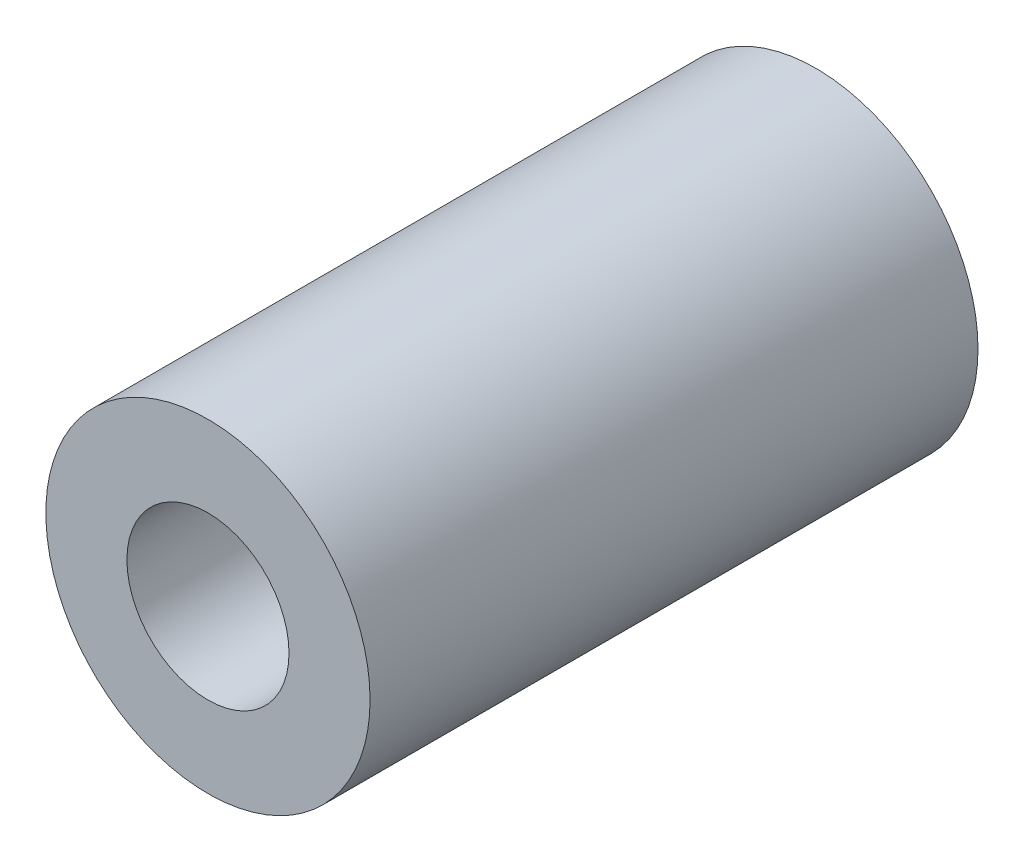
ISO-10303-21;
HEADER;
FILE_DESCRIPTION(('STEP AP214'),'2;1');
FILE_NAME('part.step','',(''),(''),'','','');
FILE_SCHEMA(('AUTOMOTIVE_DESIGN { 1 0 10303 214 1 1 1 1 }'));
ENDSEC;
DATA;
#1=APPLICATION_CONTEXT('core data for automotive mechanical design processes');
#2=APPLICATION_PROTOCOL_DEFINITION('international standard','automotive_design',2000,#1);
#3=PRODUCT_CONTEXT('',#1,'mechanical');
#4=PRODUCT('Part','Part','',(#3));
#5=PRODUCT_RELATED_PRODUCT_CATEGORY('part','',(#4));
#6=PRODUCT_DEFINITION_FORMATION('','',#4);
#7=PRODUCT_DEFINITION_CONTEXT('part definition',#1,'design');
#8=PRODUCT_DEFINITION('design','',#6,#7);
#9=PRODUCT_DEFINITION_SHAPE('','',#8);
#10=(LENGTH_UNIT() NAMED_UNIT(*) SI_UNIT(.MILLI.,.METRE.));
#11=(NAMED_UNIT(*) PLANE_ANGLE_UNIT() SI_UNIT($,.RADIAN.));
#12=(NAMED_UNIT(*) SI_UNIT($,.STERADIAN.) SOLID_ANGLE_UNIT());
#13=UNCERTAINTY_MEASURE_WITH_UNIT(LENGTH_MEASURE(1.E-05),#10,'distance_accuracy_value','');
#14=(GEOMETRIC_REPRESENTATION_CONTEXT(3) GLOBAL_UNCERTAINTY_ASSIGNED_CONTEXT((#13)) GLOBAL_UNIT_ASSIGNED_CONTEXT((#10,
#11,#12)) REPRESENTATION_CONTEXT('',''));
#15=CARTESIAN_POINT('',(0.,0.,0.));
#16=DIRECTION('',(0.,0.,1.));
#17=DIRECTION('',(1.,0.,0.));
#18=AXIS2_PLACEMENT_3D('',#15,#16,#17);
#19=CARTESIAN_POINT('',(0.,0.,30.));
#20=DIRECTION('',(0.,0.,1.));
#21=DIRECTION('',(1.,0.,0.));
#22=AXIS2_PLACEMENT_3D('',#19,#20,#21);
#23=PLANE('',#22);
#24=CARTESIAN_POINT('',(0.,0.,30.));
#25=DIRECTION('',(0.,0.,1.));
#26=DIRECTION('',(1.,0.,0.));
#27=AXIS2_PLACEMENT_3D('',#24,#25,#26);
#28=CIRCLE('',#27,8.);
#29=CARTESIAN_POINT('',(8.,0.,30.));
#30=VERTEX_POINT('',#29);
#31=EDGE_CURVE('E10',#30,#30,#28,.T.);
#32=ORIENTED_EDGE('',*,*,#31,.T.);
#33=EDGE_LOOP('',(#32));
#34=FACE_BOUND('',#33,.T.);
#35=CARTESIAN_POINT('',(0.,0.,30.));
#36=DIRECTION('',(0.,0.,1.));
#37=DIRECTION('',(1.,0.,0.));
#38=AXIS2_PLACEMENT_3D('',#35,#36,#37);
#39=CIRCLE('',#38,4.);
#40=CARTESIAN_POINT('',(4.,0.,30.));
#41=VERTEX_POINT('',#40);
#42=EDGE_CURVE('E48',#41,#41,#39,.T.);
#43=ORIENTED_EDGE('',*,*,#42,.F.);
#44=EDGE_LOOP('',(#43));
#45=FACE_BOUND('',#44,.T.);
#46=ADVANCED_FACE('F34',(#34,#45),#23,.T.);
#47=CARTESIAN_POINT('',(0.,0.,0.));
#48=DIRECTION('',(0.,0.,1.));
#49=DIRECTION('',(1.,0.,0.));
#50=AXIS2_PLACEMENT_3D('',#47,#48,#49);
#51=PLANE('',#50);
#52=CARTESIAN_POINT('',(0.,0.,0.));
#53=DIRECTION('',(0.,0.,1.));
#54=DIRECTION('',(1.,0.,0.));
#55=AXIS2_PLACEMENT_3D('',#52,#53,#54);
#56=CIRCLE('',#55,8.);
#57=CARTESIAN_POINT('',(8.,0.,0.));
#58=VERTEX_POINT('',#57);
#59=EDGE_CURVE('E38',#58,#58,#56,.T.);
#60=ORIENTED_EDGE('',*,*,#59,.F.);
#61=EDGE_LOOP('',(#60));
#62=FACE_BOUND('',#61,.T.);
#63=CARTESIAN_POINT('',(0.,0.,0.));
#64=DIRECTION('',(0.,0.,1.));
#65=DIRECTION('',(1.,0.,0.));
#66=AXIS2_PLACEMENT_3D('',#63,#64,#65);
#67=CIRCLE('',#66,4.);
#68=CARTESIAN_POINT('',(4.,0.,0.));
#69=VERTEX_POINT('',#68);
#70=EDGE_CURVE('E50',#69,#69,#67,.T.);
#71=ORIENTED_EDGE('',*,*,#70,.T.);
#72=EDGE_LOOP('',(#71));
#73=FACE_BOUND('',#72,.T.);
#74=ADVANCED_FACE('F61',(#62,#73),#51,.F.);
#75=CARTESIAN_POINT('',(0.,0.,30.));
#76=DIRECTION('',(0.,0.,-1.));
#77=DIRECTION('',(-1.,0.,0.));
#78=AXIS2_PLACEMENT_3D('',#75,#76,#77);
#79=CYLINDRICAL_SURFACE('',#78,8.);
#80=ORIENTED_EDGE('',*,*,#31,.F.);
#81=EDGE_LOOP('',(#80));
#82=FACE_BOUND('',#81,.T.);
#83=ORIENTED_EDGE('',*,*,#59,.T.);
#84=EDGE_LOOP('',(#83));
#85=FACE_BOUND('',#84,.T.);
#86=ADVANCED_FACE('F36',(#82,#85),#79,.T.);
#87=CARTESIAN_POINT('',(0.,0.,30.));
#88=DIRECTION('',(0.,0.,-1.));
#89=DIRECTION('',(-1.,0.,0.));
#90=AXIS2_PLACEMENT_3D('',#87,#88,#89);
#91=CYLINDRICAL_SURFACE('',#90,4.);
#92=ORIENTED_EDGE('',*,*,#42,.T.);
#93=EDGE_LOOP('',(#92));
#94=FACE_BOUND('',#93,.T.);
#95=ORIENTED_EDGE('',*,*,#70,.F.);
#96=EDGE_LOOP('',(#95));
#97=FACE_BOUND('',#96,.T.);
#98=ADVANCED_FACE('F57',(#94,#97),#91,.F.);
#99=CLOSED_SHELL('',(#46,#74,#86,#98));
#100=MANIFOLD_SOLID_BREP('B2',#99);
#101=ADVANCED_BREP_SHAPE_REPRESENTATION('',(#18,#100),#14);
#102=SHAPE_DEFINITION_REPRESENTATION(#9,#101);
ENDSEC;
END-ISO-10303-21;
